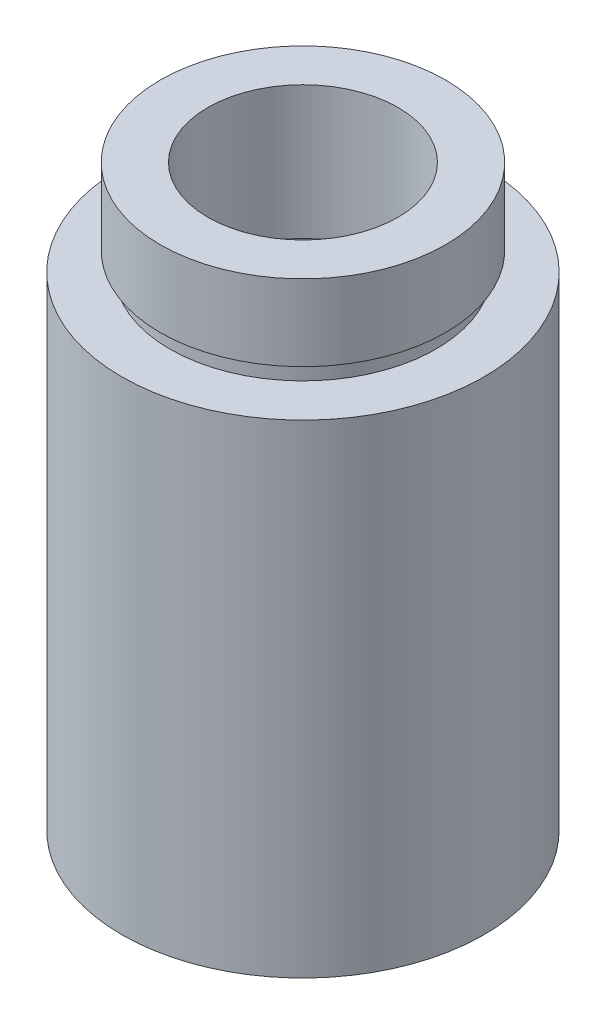
ISO-10303-21;
HEADER;
FILE_DESCRIPTION(('STEP AP214'),'2;1');
FILE_NAME('part.step','',(''),(''),'','','');
FILE_SCHEMA(('AUTOMOTIVE_DESIGN { 1 0 10303 214 1 1 1 1 }'));
ENDSEC;
DATA;
#1=APPLICATION_CONTEXT('core data for automotive mechanical design processes');
#2=APPLICATION_PROTOCOL_DEFINITION('international standard','automotive_design',2000,#1);
#3=PRODUCT_CONTEXT('',#1,'mechanical');
#4=PRODUCT('Part','Part','',(#3));
#5=PRODUCT_RELATED_PRODUCT_CATEGORY('part','',(#4));
#6=PRODUCT_DEFINITION_FORMATION('','',#4);
#7=PRODUCT_DEFINITION_CONTEXT('part definition',#1,'design');
#8=PRODUCT_DEFINITION('design','',#6,#7);
#9=PRODUCT_DEFINITION_SHAPE('','',#8);
#10=(LENGTH_UNIT() NAMED_UNIT(*) SI_UNIT(.MILLI.,.METRE.));
#11=(NAMED_UNIT(*) PLANE_ANGLE_UNIT() SI_UNIT($,.RADIAN.));
#12=(NAMED_UNIT(*) SI_UNIT($,.STERADIAN.) SOLID_ANGLE_UNIT());
#13=UNCERTAINTY_MEASURE_WITH_UNIT(LENGTH_MEASURE(1.E-05),#10,'distance_accuracy_value','');
#14=(GEOMETRIC_REPRESENTATION_CONTEXT(3) GLOBAL_UNCERTAINTY_ASSIGNED_CONTEXT((#13)) GLOBAL_UNIT_ASSIGNED_CONTEXT((#10,
#11,#12)) REPRESENTATION_CONTEXT('',''));
#15=CARTESIAN_POINT('',(0.,0.,0.));
#16=DIRECTION('',(0.,0.,1.));
#17=DIRECTION('',(1.,0.,0.));
#18=AXIS2_PLACEMENT_3D('',#15,#16,#17);
#19=CARTESIAN_POINT('',(5.00000000000002,23.4,0.));
#20=DIRECTION('',(0.,1.,0.));
#21=DIRECTION('',(0.,0.,1.));
#22=AXIS2_PLACEMENT_3D('',#19,#20,#21);
#23=PLANE('',#22);
#24=CARTESIAN_POINT('',(0.,23.4,0.));
#25=DIRECTION('',(0.,1.,0.));
#26=DIRECTION('',(0.,0.,1.));
#27=AXIS2_PLACEMENT_3D('',#24,#25,#26);
#28=CIRCLE('',#27,6.85000000000002);
#29=CARTESIAN_POINT('',(0.,23.4,6.85000000000002));
#30=VERTEX_POINT('',#29);
#31=EDGE_CURVE('E89',#30,#30,#28,.T.);
#32=ORIENTED_EDGE('',*,*,#31,.F.);
#33=EDGE_LOOP('',(#32));
#34=FACE_BOUND('',#33,.T.);
#35=CARTESIAN_POINT('',(0.,23.4,0.));
#36=DIRECTION('',(0.,1.,0.));
#37=DIRECTION('',(0.,0.,1.));
#38=AXIS2_PLACEMENT_3D('',#35,#36,#37);
#39=CIRCLE('',#38,5.00000000000002);
#40=CARTESIAN_POINT('',(0.,23.4,5.00000000000002));
#41=VERTEX_POINT('',#40);
#42=EDGE_CURVE('E10',#41,#41,#39,.T.);
#43=ORIENTED_EDGE('',*,*,#42,.T.);
#44=EDGE_LOOP('',(#43));
#45=FACE_BOUND('',#44,.T.);
#46=ADVANCED_FACE('F37',(#34,#45),#23,.F.);
#47=CARTESIAN_POINT('',(0.,161.376166943427,0.));
#48=DIRECTION('',(0.,1.,0.));
#49=DIRECTION('',(0.,0.,1.));
#50=AXIS2_PLACEMENT_3D('',#47,#48,#49);
#51=CYLINDRICAL_SURFACE('',#50,5.00000000000002);
#52=ORIENTED_EDGE('',*,*,#42,.F.);
#53=EDGE_LOOP('',(#52));
#54=FACE_BOUND('',#53,.T.);
#55=CARTESIAN_POINT('',(0.,30.4,0.));
#56=DIRECTION('',(0.,1.,0.));
#57=DIRECTION('',(0.,0.,1.));
#58=AXIS2_PLACEMENT_3D('',#55,#56,#57);
#59=CIRCLE('',#58,5.00000000000002);
#60=CARTESIAN_POINT('',(0.,30.4,5.00000000000002));
#61=VERTEX_POINT('',#60);
#62=EDGE_CURVE('E43',#61,#61,#59,.T.);
#63=ORIENTED_EDGE('',*,*,#62,.T.);
#64=EDGE_LOOP('',(#63));
#65=FACE_BOUND('',#64,.T.);
#66=ADVANCED_FACE('F96',(#54,#65),#51,.F.);
#67=CARTESIAN_POINT('',(5.00000000000002,30.4,0.));
#68=DIRECTION('',(0.,-1.,0.));
#69=DIRECTION('',(0.,0.,-1.));
#70=AXIS2_PLACEMENT_3D('',#67,#68,#69);
#71=PLANE('',#70);
#72=ORIENTED_EDGE('',*,*,#62,.F.);
#73=EDGE_LOOP('',(#72));
#74=FACE_BOUND('',#73,.T.);
#75=CARTESIAN_POINT('',(0.,30.4,0.));
#76=DIRECTION('',(0.,1.,0.));
#77=DIRECTION('',(0.,0.,1.));
#78=AXIS2_PLACEMENT_3D('',#75,#76,#77);
#79=CIRCLE('',#78,7.50000000000002);
#80=CARTESIAN_POINT('',(0.,30.4,7.50000000000002));
#81=VERTEX_POINT('',#80);
#82=EDGE_CURVE('E47',#81,#81,#79,.T.);
#83=ORIENTED_EDGE('',*,*,#82,.T.);
#84=EDGE_LOOP('',(#83));
#85=FACE_BOUND('',#84,.T.);
#86=ADVANCED_FACE('F100',(#74,#85),#71,.F.);
#87=CARTESIAN_POINT('',(0.,161.376166943427,0.));
#88=DIRECTION('',(0.,1.,0.));
#89=DIRECTION('',(0.,0.,1.));
#90=AXIS2_PLACEMENT_3D('',#87,#88,#89);
#91=CYLINDRICAL_SURFACE('',#90,7.50000000000002);
#92=ORIENTED_EDGE('',*,*,#82,.F.);
#93=EDGE_LOOP('',(#92));
#94=FACE_BOUND('',#93,.T.);
#95=CARTESIAN_POINT('',(0.,26.4,0.));
#96=DIRECTION('',(0.,1.,0.));
#97=DIRECTION('',(0.,0.,1.));
#98=AXIS2_PLACEMENT_3D('',#95,#96,#97);
#99=CIRCLE('',#98,7.50000000000001);
#100=CARTESIAN_POINT('',(0.,26.4,7.50000000000001));
#101=VERTEX_POINT('',#100);
#102=EDGE_CURVE('E51',#101,#101,#99,.T.);
#103=ORIENTED_EDGE('',*,*,#102,.T.);
#104=EDGE_LOOP('',(#103));
#105=FACE_BOUND('',#104,.T.);
#106=ADVANCED_FACE('F105',(#94,#105),#91,.T.);
#107=CARTESIAN_POINT('',(7.00000000000002,26.4,0.));
#108=DIRECTION('',(0.,1.,0.));
#109=DIRECTION('',(0.,0.,1.));
#110=AXIS2_PLACEMENT_3D('',#107,#108,#109);
#111=PLANE('',#110);
#112=ORIENTED_EDGE('',*,*,#102,.F.);
#113=EDGE_LOOP('',(#112));
#114=FACE_BOUND('',#113,.T.);
#115=CARTESIAN_POINT('',(0.,26.4,0.));
#116=DIRECTION('',(0.,1.,0.));
#117=DIRECTION('',(0.,0.,1.));
#118=AXIS2_PLACEMENT_3D('',#115,#116,#117);
#119=CIRCLE('',#118,7.00000000000002);
#120=CARTESIAN_POINT('',(0.,26.4,7.00000000000002));
#121=VERTEX_POINT('',#120);
#122=EDGE_CURVE('E56',#121,#121,#119,.T.);
#123=ORIENTED_EDGE('',*,*,#122,.T.);
#124=EDGE_LOOP('',(#123));
#125=FACE_BOUND('',#124,.T.);
#126=ADVANCED_FACE('F111',(#114,#125),#111,.F.);
#127=CARTESIAN_POINT('',(0.,161.376166943427,0.));
#128=DIRECTION('',(0.,1.,0.));
#129=DIRECTION('',(0.,0.,1.));
#130=AXIS2_PLACEMENT_3D('',#127,#128,#129);
#131=CYLINDRICAL_SURFACE('',#130,7.00000000000002);
#132=ORIENTED_EDGE('',*,*,#122,.F.);
#133=EDGE_LOOP('',(#132));
#134=FACE_BOUND('',#133,.T.);
#135=CARTESIAN_POINT('',(0.,25.4,0.));
#136=DIRECTION('',(0.,1.,0.));
#137=DIRECTION('',(0.,0.,1.));
#138=AXIS2_PLACEMENT_3D('',#135,#136,#137);
#139=CIRCLE('',#138,7.00000000000002);
#140=CARTESIAN_POINT('',(0.,25.4,7.00000000000002));
#141=VERTEX_POINT('',#140);
#142=EDGE_CURVE('E59',#141,#141,#139,.T.);
#143=ORIENTED_EDGE('',*,*,#142,.T.);
#144=EDGE_LOOP('',(#143));
#145=FACE_BOUND('',#144,.T.);
#146=ADVANCED_FACE('F115',(#134,#145),#131,.T.);
#147=CARTESIAN_POINT('',(7.00000000000002,25.4,0.));
#148=DIRECTION('',(0.,-1.,0.));
#149=DIRECTION('',(0.,0.,-1.));
#150=AXIS2_PLACEMENT_3D('',#147,#148,#149);
#151=PLANE('',#150);
#152=ORIENTED_EDGE('',*,*,#142,.F.);
#153=EDGE_LOOP('',(#152));
#154=FACE_BOUND('',#153,.T.);
#155=CARTESIAN_POINT('',(0.,25.4,0.));
#156=DIRECTION('',(0.,1.,0.));
#157=DIRECTION('',(0.,0.,1.));
#158=AXIS2_PLACEMENT_3D('',#155,#156,#157);
#159=CIRCLE('',#158,9.52500000000002);
#160=CARTESIAN_POINT('',(0.,25.4,9.52500000000002));
#161=VERTEX_POINT('',#160);
#162=EDGE_CURVE('E62',#161,#161,#159,.T.);
#163=ORIENTED_EDGE('',*,*,#162,.T.);
#164=EDGE_LOOP('',(#163));
#165=FACE_BOUND('',#164,.T.);
#166=ADVANCED_FACE('F119',(#154,#165),#151,.F.);
#167=CARTESIAN_POINT('',(0.,161.376166943427,0.));
#168=DIRECTION('',(0.,1.,0.));
#169=DIRECTION('',(0.,0.,1.));
#170=AXIS2_PLACEMENT_3D('',#167,#168,#169);
#171=CYLINDRICAL_SURFACE('',#170,9.52500000000002);
#172=ORIENTED_EDGE('',*,*,#162,.F.);
#173=EDGE_LOOP('',(#172));
#174=FACE_BOUND('',#173,.T.);
#175=CARTESIAN_POINT('',(0.,0.,0.));
#176=DIRECTION('',(0.,1.,0.));
#177=DIRECTION('',(0.,0.,1.));
#178=AXIS2_PLACEMENT_3D('',#175,#176,#177);
#179=CIRCLE('',#178,9.52500000000002);
#180=CARTESIAN_POINT('',(0.,0.,9.52500000000002));
#181=VERTEX_POINT('',#180);
#182=EDGE_CURVE('E65',#181,#181,#179,.T.);
#183=ORIENTED_EDGE('',*,*,#182,.T.);
#184=EDGE_LOOP('',(#183));
#185=FACE_BOUND('',#184,.T.);
#186=ADVANCED_FACE('F123',(#174,#185),#171,.T.);
#187=CARTESIAN_POINT('',(9.52500000000002,0.,0.));
#188=DIRECTION('',(0.,1.,0.));
#189=DIRECTION('',(0.,0.,1.));
#190=AXIS2_PLACEMENT_3D('',#187,#188,#189);
#191=PLANE('',#190);
#192=ORIENTED_EDGE('',*,*,#182,.F.);
#193=EDGE_LOOP('',(#192));
#194=FACE_BOUND('',#193,.T.);
#195=CARTESIAN_POINT('',(0.,0.,0.));
#196=DIRECTION('',(0.,1.,0.));
#197=DIRECTION('',(0.,0.,1.));
#198=AXIS2_PLACEMENT_3D('',#195,#196,#197);
#199=CIRCLE('',#198,7.00000000000002);
#200=CARTESIAN_POINT('',(0.,0.,7.00000000000002));
#201=VERTEX_POINT('',#200);
#202=EDGE_CURVE('E68',#201,#201,#199,.T.);
#203=ORIENTED_EDGE('',*,*,#202,.T.);
#204=EDGE_LOOP('',(#203));
#205=FACE_BOUND('',#204,.T.);
#206=ADVANCED_FACE('F127',(#194,#205),#191,.F.);
#207=CARTESIAN_POINT('',(0.,161.376166943427,0.));
#208=DIRECTION('',(0.,1.,0.));
#209=DIRECTION('',(0.,0.,1.));
#210=AXIS2_PLACEMENT_3D('',#207,#208,#209);
#211=CYLINDRICAL_SURFACE('',#210,7.00000000000002);
#212=ORIENTED_EDGE('',*,*,#202,.F.);
#213=EDGE_LOOP('',(#212));
#214=FACE_BOUND('',#213,.T.);
#215=CARTESIAN_POINT('',(0.,4.49999999999998,0.));
#216=DIRECTION('',(0.,1.,0.));
#217=DIRECTION('',(0.,0.,1.));
#218=AXIS2_PLACEMENT_3D('',#215,#216,#217);
#219=CIRCLE('',#218,7.00000000000002);
#220=CARTESIAN_POINT('',(0.,4.49999999999998,7.00000000000002));
#221=VERTEX_POINT('',#220);
#222=EDGE_CURVE('E71',#221,#221,#219,.T.);
#223=ORIENTED_EDGE('',*,*,#222,.T.);
#224=EDGE_LOOP('',(#223));
#225=FACE_BOUND('',#224,.T.);
#226=ADVANCED_FACE('F131',(#214,#225),#211,.F.);
#227=CARTESIAN_POINT('',(7.00000000000002,4.49999999999998,0.));
#228=DIRECTION('',(0.,-1.,0.));
#229=DIRECTION('',(0.,0.,-1.));
#230=AXIS2_PLACEMENT_3D('',#227,#228,#229);
#231=PLANE('',#230);
#232=ORIENTED_EDGE('',*,*,#222,.F.);
#233=EDGE_LOOP('',(#232));
#234=FACE_BOUND('',#233,.T.);
#235=CARTESIAN_POINT('',(0.,4.49999999999998,0.));
#236=DIRECTION('',(0.,1.,0.));
#237=DIRECTION('',(0.,0.,1.));
#238=AXIS2_PLACEMENT_3D('',#235,#236,#237);
#239=CIRCLE('',#238,7.60000000000002);
#240=CARTESIAN_POINT('',(0.,4.49999999999998,7.60000000000002));
#241=VERTEX_POINT('',#240);
#242=EDGE_CURVE('E74',#241,#241,#239,.T.);
#243=ORIENTED_EDGE('',*,*,#242,.T.);
#244=EDGE_LOOP('',(#243));
#245=FACE_BOUND('',#244,.T.);
#246=ADVANCED_FACE('F135',(#234,#245),#231,.F.);
#247=CARTESIAN_POINT('',(0.,161.376166943427,0.));
#248=DIRECTION('',(0.,1.,0.));
#249=DIRECTION('',(0.,0.,1.));
#250=AXIS2_PLACEMENT_3D('',#247,#248,#249);
#251=CYLINDRICAL_SURFACE('',#250,7.60000000000002);
#252=ORIENTED_EDGE('',*,*,#242,.F.);
#253=EDGE_LOOP('',(#252));
#254=FACE_BOUND('',#253,.T.);
#255=CARTESIAN_POINT('',(0.,5.49999999999998,0.));
#256=DIRECTION('',(0.,1.,0.));
#257=DIRECTION('',(0.,0.,1.));
#258=AXIS2_PLACEMENT_3D('',#255,#256,#257);
#259=CIRCLE('',#258,7.60000000000002);
#260=CARTESIAN_POINT('',(0.,5.49999999999998,7.60000000000002));
#261=VERTEX_POINT('',#260);
#262=EDGE_CURVE('E77',#261,#261,#259,.T.);
#263=ORIENTED_EDGE('',*,*,#262,.T.);
#264=EDGE_LOOP('',(#263));
#265=FACE_BOUND('',#264,.T.);
#266=ADVANCED_FACE('F139',(#254,#265),#251,.F.);
#267=CARTESIAN_POINT('',(6.75000000000002,5.49999999999998,0.));
#268=DIRECTION('',(0.,1.,0.));
#269=DIRECTION('',(0.,0.,1.));
#270=AXIS2_PLACEMENT_3D('',#267,#268,#269);
#271=PLANE('',#270);
#272=ORIENTED_EDGE('',*,*,#262,.F.);
#273=EDGE_LOOP('',(#272));
#274=FACE_BOUND('',#273,.T.);
#275=CARTESIAN_POINT('',(0.,5.49999999999998,0.));
#276=DIRECTION('',(0.,1.,0.));
#277=DIRECTION('',(0.,0.,1.));
#278=AXIS2_PLACEMENT_3D('',#275,#276,#277);
#279=CIRCLE('',#278,6.75000000000002);
#280=CARTESIAN_POINT('',(0.,5.49999999999998,6.75000000000002));
#281=VERTEX_POINT('',#280);
#282=EDGE_CURVE('E80',#281,#281,#279,.T.);
#283=ORIENTED_EDGE('',*,*,#282,.T.);
#284=EDGE_LOOP('',(#283));
#285=FACE_BOUND('',#284,.T.);
#286=ADVANCED_FACE('F143',(#274,#285),#271,.F.);
#287=CARTESIAN_POINT('',(0.,161.376166943427,0.));
#288=DIRECTION('',(0.,1.,0.));
#289=DIRECTION('',(0.,0.,1.));
#290=AXIS2_PLACEMENT_3D('',#287,#288,#289);
#291=CYLINDRICAL_SURFACE('',#290,6.75000000000002);
#292=ORIENTED_EDGE('',*,*,#282,.F.);
#293=EDGE_LOOP('',(#292));
#294=FACE_BOUND('',#293,.T.);
#295=CARTESIAN_POINT('',(0.,22.4,0.));
#296=DIRECTION('',(0.,1.,0.));
#297=DIRECTION('',(0.,0.,1.));
#298=AXIS2_PLACEMENT_3D('',#295,#296,#297);
#299=CIRCLE('',#298,6.75000000000002);
#300=CARTESIAN_POINT('',(0.,22.4,6.75000000000002));
#301=VERTEX_POINT('',#300);
#302=EDGE_CURVE('E83',#301,#301,#299,.T.);
#303=ORIENTED_EDGE('',*,*,#302,.T.);
#304=EDGE_LOOP('',(#303));
#305=FACE_BOUND('',#304,.T.);
#306=ADVANCED_FACE('F147',(#294,#305),#291,.F.);
#307=CARTESIAN_POINT('',(6.75000000000002,22.4,0.));
#308=DIRECTION('',(0.,-1.,0.));
#309=DIRECTION('',(0.,0.,-1.));
#310=AXIS2_PLACEMENT_3D('',#307,#308,#309);
#311=PLANE('',#310);
#312=ORIENTED_EDGE('',*,*,#302,.F.);
#313=EDGE_LOOP('',(#312));
#314=FACE_BOUND('',#313,.T.);
#315=CARTESIAN_POINT('',(0.,22.4,0.));
#316=DIRECTION('',(0.,1.,0.));
#317=DIRECTION('',(0.,0.,1.));
#318=AXIS2_PLACEMENT_3D('',#315,#316,#317);
#319=CIRCLE('',#318,6.85000000000002);
#320=CARTESIAN_POINT('',(0.,22.4,6.85000000000002));
#321=VERTEX_POINT('',#320);
#322=EDGE_CURVE('E86',#321,#321,#319,.T.);
#323=ORIENTED_EDGE('',*,*,#322,.T.);
#324=EDGE_LOOP('',(#323));
#325=FACE_BOUND('',#324,.T.);
#326=ADVANCED_FACE('F151',(#314,#325),#311,.F.);
#327=CARTESIAN_POINT('',(0.,161.376166943427,0.));
#328=DIRECTION('',(0.,1.,0.));
#329=DIRECTION('',(0.,0.,1.));
#330=AXIS2_PLACEMENT_3D('',#327,#328,#329);
#331=CYLINDRICAL_SURFACE('',#330,6.85000000000002);
#332=ORIENTED_EDGE('',*,*,#322,.F.);
#333=EDGE_LOOP('',(#332));
#334=FACE_BOUND('',#333,.T.);
#335=ORIENTED_EDGE('',*,*,#31,.T.);
#336=EDGE_LOOP('',(#335));
#337=FACE_BOUND('',#336,.T.);
#338=ADVANCED_FACE('F93',(#334,#337),#331,.F.);
#339=CLOSED_SHELL('',(#46,#66,#86,#106,#126,#146,#166,#186,#206,#226,#246,#266,#286,#306,#326,#338));
#340=MANIFOLD_SOLID_BREP('B2',#339);
#341=ADVANCED_BREP_SHAPE_REPRESENTATION('',(#18,#340),#14);
#342=SHAPE_DEFINITION_REPRESENTATION(#9,#341);
ENDSEC;
END-ISO-10303-21;
